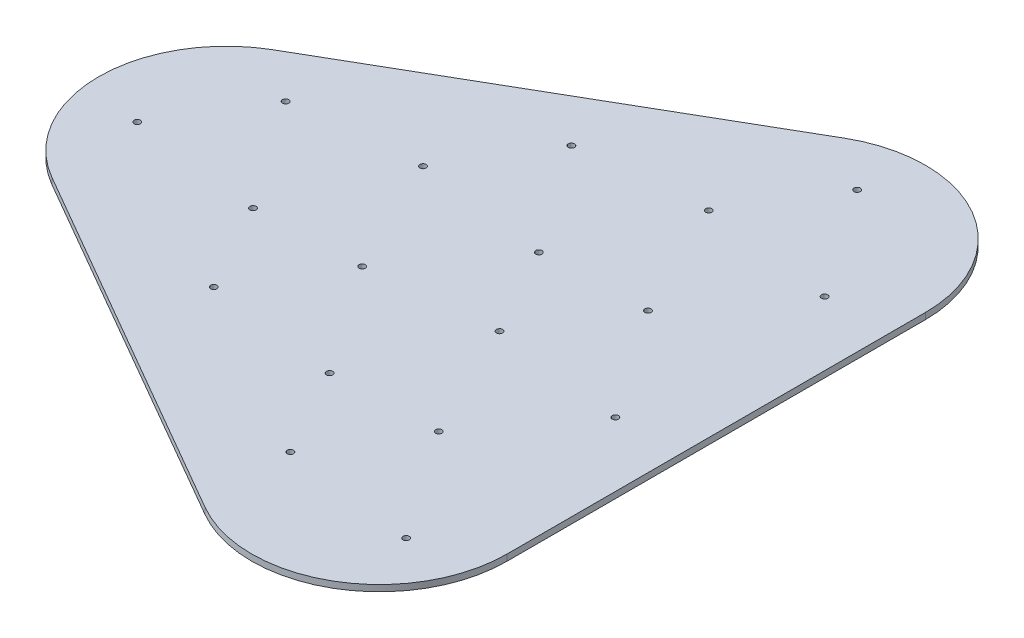
ISO-10303-21;
HEADER;
FILE_DESCRIPTION(('STEP AP214'),'2;1');
FILE_NAME('part.step','',(''),(''),'','','');
FILE_SCHEMA(('AUTOMOTIVE_DESIGN { 1 0 10303 214 1 1 1 1 }'));
ENDSEC;
DATA;
#1=APPLICATION_CONTEXT('core data for automotive mechanical design processes');
#2=APPLICATION_PROTOCOL_DEFINITION('international standard','automotive_design',2000,#1);
#3=PRODUCT_CONTEXT('',#1,'mechanical');
#4=PRODUCT('Part','Part','',(#3));
#5=PRODUCT_RELATED_PRODUCT_CATEGORY('part','',(#4));
#6=PRODUCT_DEFINITION_FORMATION('','',#4);
#7=PRODUCT_DEFINITION_CONTEXT('part definition',#1,'design');
#8=PRODUCT_DEFINITION('design','',#6,#7);
#9=PRODUCT_DEFINITION_SHAPE('','',#8);
#10=(LENGTH_UNIT() NAMED_UNIT(*) SI_UNIT(.MILLI.,.METRE.));
#11=(NAMED_UNIT(*) PLANE_ANGLE_UNIT() SI_UNIT($,.RADIAN.));
#12=(NAMED_UNIT(*) SI_UNIT($,.STERADIAN.) SOLID_ANGLE_UNIT());
#13=UNCERTAINTY_MEASURE_WITH_UNIT(LENGTH_MEASURE(1.E-05),#10,'distance_accuracy_value','');
#14=(GEOMETRIC_REPRESENTATION_CONTEXT(3) GLOBAL_UNCERTAINTY_ASSIGNED_CONTEXT((#13)) GLOBAL_UNIT_ASSIGNED_CONTEXT((#10,
#11,#12)) REPRESENTATION_CONTEXT('',''));
#15=CARTESIAN_POINT('',(0.,0.,0.));
#16=DIRECTION('',(0.,0.,1.));
#17=DIRECTION('',(1.,0.,0.));
#18=AXIS2_PLACEMENT_3D('',#15,#16,#17);
#19=CARTESIAN_POINT('',(-30.5,3.,-52.8275496308508));
#20=DIRECTION('',(-0.5,0.,-0.866025403784439));
#21=DIRECTION('',(-0.866025403784439,0.,0.5));
#22=AXIS2_PLACEMENT_3D('',#19,#20,#21);
#23=PLANE('',#22);
#24=DIRECTION('',(0.866025403784439,0.,-0.5));
#25=VECTOR('',#24,1.);
#26=CARTESIAN_POINT('',(-30.5,0.,-52.8275496308508));
#27=LINE('',#26,#25);
#28=CARTESIAN_POINT('',(-30.5,0.,-52.8275496308508));
#29=VERTEX_POINT('',#28);
#30=CARTESIAN_POINT('',(142.705080756888,0.,-152.827549630851));
#31=VERTEX_POINT('',#30);
#32=EDGE_CURVE('E172',#29,#31,#27,.T.);
#33=ORIENTED_EDGE('',*,*,#32,.F.);
#34=DIRECTION('',(0.,-1.,0.));
#35=VECTOR('',#34,1.);
#36=CARTESIAN_POINT('',(-30.5,3.,-52.8275496308508));
#37=LINE('',#36,#35);
#38=CARTESIAN_POINT('',(-30.5,3.,-52.8275496308508));
#39=VERTEX_POINT('',#38);
#40=EDGE_CURVE('E11',#39,#29,#37,.T.);
#41=ORIENTED_EDGE('',*,*,#40,.F.);
#42=DIRECTION('',(0.866025403784439,0.,-0.5));
#43=VECTOR('',#42,1.);
#44=CARTESIAN_POINT('',(-30.5,3.,-52.8275496308508));
#45=LINE('',#44,#43);
#46=CARTESIAN_POINT('',(142.705080756888,3.,-152.827549630851));
#47=VERTEX_POINT('',#46);
#48=EDGE_CURVE('E238',#39,#47,#45,.T.);
#49=ORIENTED_EDGE('',*,*,#48,.T.);
#50=DIRECTION('',(0.,-1.,0.));
#51=VECTOR('',#50,1.);
#52=CARTESIAN_POINT('',(142.705080756888,3.,-152.827549630851));
#53=LINE('',#52,#51);
#54=EDGE_CURVE('E79',#47,#31,#53,.T.);
#55=ORIENTED_EDGE('',*,*,#54,.T.);
#56=EDGE_LOOP('',(#33,#41,#49,#55));
#57=FACE_BOUND('',#56,.T.);
#58=ADVANCED_FACE('F35',(#57),#23,.T.);
#59=CARTESIAN_POINT('',(0.,3.,0.));
#60=DIRECTION('',(0.,-1.,0.));
#61=DIRECTION('',(0.,0.,-1.));
#62=AXIS2_PLACEMENT_3D('',#59,#60,#61);
#63=CYLINDRICAL_SURFACE('',#62,61.);
#64=CARTESIAN_POINT('',(0.,0.,0.));
#65=DIRECTION('',(0.,1.,0.));
#66=DIRECTION('',(0.,0.,1.));
#67=AXIS2_PLACEMENT_3D('',#64,#65,#66);
#68=CIRCLE('',#67,61.);
#69=CARTESIAN_POINT('',(-30.5,0.,52.8275496308508));
#70=VERTEX_POINT('',#69);
#71=EDGE_CURVE('E175',#29,#70,#68,.T.);
#72=ORIENTED_EDGE('',*,*,#71,.T.);
#73=DIRECTION('',(0.,-1.,0.));
#74=VECTOR('',#73,1.);
#75=CARTESIAN_POINT('',(-30.5,3.,52.8275496308508));
#76=LINE('',#75,#74);
#77=CARTESIAN_POINT('',(-30.5,3.,52.8275496308508));
#78=VERTEX_POINT('',#77);
#79=EDGE_CURVE('E43',#78,#70,#76,.T.);
#80=ORIENTED_EDGE('',*,*,#79,.F.);
#81=CARTESIAN_POINT('',(0.,3.,0.));
#82=DIRECTION('',(0.,1.,0.));
#83=DIRECTION('',(0.,0.,1.));
#84=AXIS2_PLACEMENT_3D('',#81,#82,#83);
#85=CIRCLE('',#84,61.);
#86=EDGE_CURVE('E252',#39,#78,#85,.T.);
#87=ORIENTED_EDGE('',*,*,#86,.F.);
#88=ORIENTED_EDGE('',*,*,#40,.T.);
#89=EDGE_LOOP('',(#72,#80,#87,#88));
#90=FACE_BOUND('',#89,.T.);
#91=ADVANCED_FACE('F255',(#90),#63,.T.);
#92=CARTESIAN_POINT('',(-30.5,3.,52.8275496308508));
#93=DIRECTION('',(0.5,0.,-0.866025403784439));
#94=DIRECTION('',(-0.866025403784439,0.,-0.5));
#95=AXIS2_PLACEMENT_3D('',#92,#93,#94);
#96=PLANE('',#95);
#97=DIRECTION('',(0.866025403784439,0.,0.5));
#98=VECTOR('',#97,1.);
#99=CARTESIAN_POINT('',(-30.5,0.,52.8275496308508));
#100=LINE('',#99,#98);
#101=CARTESIAN_POINT('',(142.705080756888,0.,152.827549630851));
#102=VERTEX_POINT('',#101);
#103=EDGE_CURVE('E177',#70,#102,#100,.T.);
#104=ORIENTED_EDGE('',*,*,#103,.T.);
#105=DIRECTION('',(0.,-1.,0.));
#106=VECTOR('',#105,1.);
#107=CARTESIAN_POINT('',(142.705080756888,3.,152.827549630851));
#108=LINE('',#107,#106);
#109=CARTESIAN_POINT('',(142.705080756888,3.,152.827549630851));
#110=VERTEX_POINT('',#109);
#111=EDGE_CURVE('E111',#110,#102,#108,.T.);
#112=ORIENTED_EDGE('',*,*,#111,.F.);
#113=DIRECTION('',(0.866025403784439,0.,0.5));
#114=VECTOR('',#113,1.);
#115=CARTESIAN_POINT('',(-30.5,3.,52.8275496308508));
#116=LINE('',#115,#114);
#117=EDGE_CURVE('E98',#78,#110,#116,.T.);
#118=ORIENTED_EDGE('',*,*,#117,.F.);
#119=ORIENTED_EDGE('',*,*,#79,.T.);
#120=EDGE_LOOP('',(#104,#112,#118,#119));
#121=FACE_BOUND('',#120,.T.);
#122=ADVANCED_FACE('F245',(#121),#96,.F.);
#123=CARTESIAN_POINT('',(173.205080756888,3.,100.));
#124=DIRECTION('',(0.,-1.,0.));
#125=DIRECTION('',(0.,0.,-1.));
#126=AXIS2_PLACEMENT_3D('',#123,#124,#125);
#127=CYLINDRICAL_SURFACE('',#126,61.);
#128=CARTESIAN_POINT('',(173.205080756888,0.,100.));
#129=DIRECTION('',(0.,1.,0.));
#130=DIRECTION('',(0.,0.,1.));
#131=AXIS2_PLACEMENT_3D('',#128,#129,#130);
#132=CIRCLE('',#131,61.);
#133=CARTESIAN_POINT('',(234.205080756888,0.,100.));
#134=VERTEX_POINT('',#133);
#135=EDGE_CURVE('E107',#102,#134,#132,.T.);
#136=ORIENTED_EDGE('',*,*,#135,.T.);
#137=DIRECTION('',(0.,-1.,0.));
#138=VECTOR('',#137,1.);
#139=CARTESIAN_POINT('',(234.205080756888,3.,100.));
#140=LINE('',#139,#138);
#141=CARTESIAN_POINT('',(234.205080756888,3.,100.));
#142=VERTEX_POINT('',#141);
#143=EDGE_CURVE('E104',#142,#134,#140,.T.);
#144=ORIENTED_EDGE('',*,*,#143,.F.);
#145=CARTESIAN_POINT('',(173.205080756888,3.,100.));
#146=DIRECTION('',(0.,1.,0.));
#147=DIRECTION('',(0.,0.,1.));
#148=AXIS2_PLACEMENT_3D('',#145,#146,#147);
#149=CIRCLE('',#148,61.);
#150=EDGE_CURVE('E91',#110,#142,#149,.T.);
#151=ORIENTED_EDGE('',*,*,#150,.F.);
#152=ORIENTED_EDGE('',*,*,#111,.T.);
#153=EDGE_LOOP('',(#136,#144,#151,#152));
#154=FACE_BOUND('',#153,.T.);
#155=ADVANCED_FACE('F105',(#154),#127,.T.);
#156=CARTESIAN_POINT('',(234.205080756888,3.,0.));
#157=DIRECTION('',(1.,0.,0.));
#158=DIRECTION('',(0.,0.,-1.));
#159=AXIS2_PLACEMENT_3D('',#156,#157,#158);
#160=PLANE('',#159);
#161=DIRECTION('',(0.,0.,1.));
#162=VECTOR('',#161,1.);
#163=CARTESIAN_POINT('',(234.205080756888,0.,0.));
#164=LINE('',#163,#162);
#165=CARTESIAN_POINT('',(234.205080756888,0.,-100.));
#166=VERTEX_POINT('',#165);
#167=EDGE_CURVE('E180',#166,#134,#164,.T.);
#168=ORIENTED_EDGE('',*,*,#167,.F.);
#169=DIRECTION('',(0.,-1.,0.));
#170=VECTOR('',#169,1.);
#171=CARTESIAN_POINT('',(234.205080756888,3.,-100.));
#172=LINE('',#171,#170);
#173=CARTESIAN_POINT('',(234.205080756888,3.,-100.));
#174=VERTEX_POINT('',#173);
#175=EDGE_CURVE('E72',#174,#166,#172,.T.);
#176=ORIENTED_EDGE('',*,*,#175,.F.);
#177=DIRECTION('',(0.,0.,1.));
#178=VECTOR('',#177,1.);
#179=CARTESIAN_POINT('',(234.205080756888,3.,0.));
#180=LINE('',#179,#178);
#181=EDGE_CURVE('E96',#174,#142,#180,.T.);
#182=ORIENTED_EDGE('',*,*,#181,.T.);
#183=ORIENTED_EDGE('',*,*,#143,.T.);
#184=EDGE_LOOP('',(#168,#176,#182,#183));
#185=FACE_BOUND('',#184,.T.);
#186=ADVANCED_FACE('F113',(#185),#160,.T.);
#187=CARTESIAN_POINT('',(-33.02,3.,9.525));
#188=DIRECTION('',(0.,-1.,0.));
#189=DIRECTION('',(0.,0.,-1.));
#190=AXIS2_PLACEMENT_3D('',#187,#188,#189);
#191=CYLINDRICAL_SURFACE('',#190,1.5);
#192=CARTESIAN_POINT('',(-33.02,3.,9.525));
#193=DIRECTION('',(0.,1.,0.));
#194=DIRECTION('',(0.,0.,1.));
#195=AXIS2_PLACEMENT_3D('',#192,#193,#194);
#196=CIRCLE('',#195,1.5);
#197=CARTESIAN_POINT('',(-33.02,3.,11.025));
#198=VERTEX_POINT('',#197);
#199=EDGE_CURVE('E166',#198,#198,#196,.T.);
#200=ORIENTED_EDGE('',*,*,#199,.T.);
#201=EDGE_LOOP('',(#200));
#202=FACE_BOUND('',#201,.T.);
#203=CARTESIAN_POINT('',(-33.02,0.,9.525));
#204=DIRECTION('',(0.,1.,0.));
#205=DIRECTION('',(0.,0.,1.));
#206=AXIS2_PLACEMENT_3D('',#203,#204,#205);
#207=CIRCLE('',#206,1.5);
#208=CARTESIAN_POINT('',(-33.02,0.,11.025));
#209=VERTEX_POINT('',#208);
#210=EDGE_CURVE('E232',#209,#209,#207,.T.);
#211=ORIENTED_EDGE('',*,*,#210,.F.);
#212=EDGE_LOOP('',(#211));
#213=FACE_BOUND('',#212,.T.);
#214=ADVANCED_FACE('F267',(#202,#213),#191,.F.);
#215=CARTESIAN_POINT('',(30.310889,3.,17.500001));
#216=DIRECTION('',(0.,-1.,0.));
#217=DIRECTION('',(0.,0.,-1.));
#218=AXIS2_PLACEMENT_3D('',#215,#216,#217);
#219=CYLINDRICAL_SURFACE('',#218,1.5);
#220=CARTESIAN_POINT('',(30.310889,3.,17.500001));
#221=DIRECTION('',(0.,1.,0.));
#222=DIRECTION('',(0.,0.,1.));
#223=AXIS2_PLACEMENT_3D('',#220,#221,#222);
#224=CIRCLE('',#223,1.5);
#225=CARTESIAN_POINT('',(30.310889,3.,19.000001));
#226=VERTEX_POINT('',#225);
#227=EDGE_CURVE('E163',#226,#226,#224,.T.);
#228=ORIENTED_EDGE('',*,*,#227,.T.);
#229=EDGE_LOOP('',(#228));
#230=FACE_BOUND('',#229,.T.);
#231=CARTESIAN_POINT('',(30.310889,0.,17.500001));
#232=DIRECTION('',(0.,1.,0.));
#233=DIRECTION('',(0.,0.,1.));
#234=AXIS2_PLACEMENT_3D('',#231,#232,#233);
#235=CIRCLE('',#234,1.5);
#236=CARTESIAN_POINT('',(30.310889,0.,19.000001));
#237=VERTEX_POINT('',#236);
#238=EDGE_CURVE('E229',#237,#237,#235,.T.);
#239=ORIENTED_EDGE('',*,*,#238,.F.);
#240=EDGE_LOOP('',(#239));
#241=FACE_BOUND('',#240,.T.);
#242=ADVANCED_FACE('F330',(#230,#241),#219,.F.);
#243=CARTESIAN_POINT('',(80.5248543784439,3.,15.531728));
#244=DIRECTION('',(0.,-1.,0.));
#245=DIRECTION('',(0.,0.,-1.));
#246=AXIS2_PLACEMENT_3D('',#243,#244,#245);
#247=CYLINDRICAL_SURFACE('',#246,1.5);
#248=CARTESIAN_POINT('',(80.5248543784439,3.,15.531728));
#249=DIRECTION('',(0.,1.,0.));
#250=DIRECTION('',(0.,0.,1.));
#251=AXIS2_PLACEMENT_3D('',#248,#249,#250);
#252=CIRCLE('',#251,1.5);
#253=CARTESIAN_POINT('',(80.5248543784439,3.,17.031728));
#254=VERTEX_POINT('',#253);
#255=EDGE_CURVE('E160',#254,#254,#252,.T.);
#256=ORIENTED_EDGE('',*,*,#255,.T.);
#257=EDGE_LOOP('',(#256));
#258=FACE_BOUND('',#257,.T.);
#259=CARTESIAN_POINT('',(80.5248543784439,0.,15.531728));
#260=DIRECTION('',(0.,1.,0.));
#261=DIRECTION('',(0.,0.,1.));
#262=AXIS2_PLACEMENT_3D('',#259,#260,#261);
#263=CIRCLE('',#262,1.5);
#264=CARTESIAN_POINT('',(80.5248543784439,0.,17.031728));
#265=VERTEX_POINT('',#264);
#266=EDGE_CURVE('E226',#265,#265,#263,.T.);
#267=ORIENTED_EDGE('',*,*,#266,.F.);
#268=EDGE_LOOP('',(#267));
#269=FACE_BOUND('',#268,.T.);
#270=ADVANCED_FACE('F326',(#258,#269),#247,.F.);
#271=CARTESIAN_POINT('',(53.5825403784439,3.,59.525));
#272=DIRECTION('',(0.,-1.,0.));
#273=DIRECTION('',(0.,0.,-1.));
#274=AXIS2_PLACEMENT_3D('',#271,#272,#273);
#275=CYLINDRICAL_SURFACE('',#274,1.5);
#276=CARTESIAN_POINT('',(53.5825403784439,3.,59.525));
#277=DIRECTION('',(0.,1.,0.));
#278=DIRECTION('',(0.,0.,1.));
#279=AXIS2_PLACEMENT_3D('',#276,#277,#278);
#280=CIRCLE('',#279,1.5);
#281=CARTESIAN_POINT('',(53.5825403784439,3.,61.025));
#282=VERTEX_POINT('',#281);
#283=EDGE_CURVE('E157',#282,#282,#280,.T.);
#284=ORIENTED_EDGE('',*,*,#283,.T.);
#285=EDGE_LOOP('',(#284));
#286=FACE_BOUND('',#285,.T.);
#287=CARTESIAN_POINT('',(53.5825403784439,0.,59.525));
#288=DIRECTION('',(0.,1.,0.));
#289=DIRECTION('',(0.,0.,1.));
#290=AXIS2_PLACEMENT_3D('',#287,#288,#289);
#291=CIRCLE('',#290,1.5);
#292=CARTESIAN_POINT('',(53.5825403784439,0.,61.025));
#293=VERTEX_POINT('',#292);
#294=EDGE_CURVE('E223',#293,#293,#291,.T.);
#295=ORIENTED_EDGE('',*,*,#294,.F.);
#296=EDGE_LOOP('',(#295));
#297=FACE_BOUND('',#296,.T.);
#298=ADVANCED_FACE('F322',(#286,#297),#275,.F.);
#299=CARTESIAN_POINT('',(116.913429378444,3.,67.500001));
#300=DIRECTION('',(0.,-1.,0.));
#301=DIRECTION('',(0.,0.,-1.));
#302=AXIS2_PLACEMENT_3D('',#299,#300,#301);
#303=CYLINDRICAL_SURFACE('',#302,1.5);
#304=CARTESIAN_POINT('',(116.913429378444,3.,67.500001));
#305=DIRECTION('',(0.,1.,0.));
#306=DIRECTION('',(0.,0.,1.));
#307=AXIS2_PLACEMENT_3D('',#304,#305,#306);
#308=CIRCLE('',#307,1.5);
#309=CARTESIAN_POINT('',(116.913429378444,3.,69.000001));
#310=VERTEX_POINT('',#309);
#311=EDGE_CURVE('E154',#310,#310,#308,.T.);
#312=ORIENTED_EDGE('',*,*,#311,.T.);
#313=EDGE_LOOP('',(#312));
#314=FACE_BOUND('',#313,.T.);
#315=CARTESIAN_POINT('',(116.913429378444,0.,67.500001));
#316=DIRECTION('',(0.,1.,0.));
#317=DIRECTION('',(0.,0.,1.));
#318=AXIS2_PLACEMENT_3D('',#315,#316,#317);
#319=CIRCLE('',#318,1.5);
#320=CARTESIAN_POINT('',(116.913429378444,0.,69.000001));
#321=VERTEX_POINT('',#320);
#322=EDGE_CURVE('E220',#321,#321,#319,.T.);
#323=ORIENTED_EDGE('',*,*,#322,.F.);
#324=EDGE_LOOP('',(#323));
#325=FACE_BOUND('',#324,.T.);
#326=ADVANCED_FACE('F318',(#314,#325),#303,.F.);
#327=CARTESIAN_POINT('',(80.5248543784439,3.,-84.468272));
#328=DIRECTION('',(0.,-1.,0.));
#329=DIRECTION('',(0.,0.,-1.));
#330=AXIS2_PLACEMENT_3D('',#327,#328,#329);
#331=CYLINDRICAL_SURFACE('',#330,1.5);
#332=CARTESIAN_POINT('',(80.5248543784439,3.,-84.468272));
#333=DIRECTION('',(0.,1.,0.));
#334=DIRECTION('',(0.,0.,1.));
#335=AXIS2_PLACEMENT_3D('',#332,#333,#334);
#336=CIRCLE('',#335,1.5);
#337=CARTESIAN_POINT('',(80.5248543784439,3.,-82.968272));
#338=VERTEX_POINT('',#337);
#339=EDGE_CURVE('E151',#338,#338,#336,.T.);
#340=ORIENTED_EDGE('',*,*,#339,.T.);
#341=EDGE_LOOP('',(#340));
#342=FACE_BOUND('',#341,.T.);
#343=CARTESIAN_POINT('',(80.5248543784439,0.,-84.468272));
#344=DIRECTION('',(0.,1.,0.));
#345=DIRECTION('',(0.,0.,1.));
#346=AXIS2_PLACEMENT_3D('',#343,#344,#345);
#347=CIRCLE('',#346,1.5);
#348=CARTESIAN_POINT('',(80.5248543784439,0.,-82.968272));
#349=VERTEX_POINT('',#348);
#350=EDGE_CURVE('E217',#349,#349,#347,.T.);
#351=ORIENTED_EDGE('',*,*,#350,.F.);
#352=EDGE_LOOP('',(#351));
#353=FACE_BOUND('',#352,.T.);
#354=ADVANCED_FACE('F314',(#342,#353),#331,.F.);
#355=CARTESIAN_POINT('',(53.5825403784439,3.,-40.475));
#356=DIRECTION('',(0.,-1.,0.));
#357=DIRECTION('',(0.,0.,-1.));
#358=AXIS2_PLACEMENT_3D('',#355,#356,#357);
#359=CYLINDRICAL_SURFACE('',#358,1.49999999999999);
#360=CARTESIAN_POINT('',(53.5825403784439,3.,-40.475));
#361=DIRECTION('',(0.,1.,0.));
#362=DIRECTION('',(0.,0.,1.));
#363=AXIS2_PLACEMENT_3D('',#360,#361,#362);
#364=CIRCLE('',#363,1.49999999999999);
#365=CARTESIAN_POINT('',(53.5825403784439,3.,-38.975));
#366=VERTEX_POINT('',#365);
#367=EDGE_CURVE('E148',#366,#366,#364,.T.);
#368=ORIENTED_EDGE('',*,*,#367,.T.);
#369=EDGE_LOOP('',(#368));
#370=FACE_BOUND('',#369,.T.);
#371=CARTESIAN_POINT('',(53.5825403784439,0.,-40.475));
#372=DIRECTION('',(0.,1.,0.));
#373=DIRECTION('',(0.,0.,1.));
#374=AXIS2_PLACEMENT_3D('',#371,#372,#373);
#375=CIRCLE('',#374,1.49999999999999);
#376=CARTESIAN_POINT('',(53.5825403784439,0.,-38.975));
#377=VERTEX_POINT('',#376);
#378=EDGE_CURVE('E214',#377,#377,#375,.T.);
#379=ORIENTED_EDGE('',*,*,#378,.F.);
#380=EDGE_LOOP('',(#379));
#381=FACE_BOUND('',#380,.T.);
#382=ADVANCED_FACE('F310',(#370,#381),#359,.F.);
#383=CARTESIAN_POINT('',(116.913429378444,3.,-32.499999));
#384=DIRECTION('',(0.,-1.,0.));
#385=DIRECTION('',(0.,0.,-1.));
#386=AXIS2_PLACEMENT_3D('',#383,#384,#385);
#387=CYLINDRICAL_SURFACE('',#386,1.5);
#388=CARTESIAN_POINT('',(116.913429378444,3.,-32.499999));
#389=DIRECTION('',(0.,1.,0.));
#390=DIRECTION('',(0.,0.,1.));
#391=AXIS2_PLACEMENT_3D('',#388,#389,#390);
#392=CIRCLE('',#391,1.5);
#393=CARTESIAN_POINT('',(116.913429378444,3.,-30.999999));
#394=VERTEX_POINT('',#393);
#395=EDGE_CURVE('E145',#394,#394,#392,.T.);
#396=ORIENTED_EDGE('',*,*,#395,.T.);
#397=EDGE_LOOP('',(#396));
#398=FACE_BOUND('',#397,.T.);
#399=CARTESIAN_POINT('',(116.913429378444,0.,-32.499999));
#400=DIRECTION('',(0.,1.,0.));
#401=DIRECTION('',(0.,0.,1.));
#402=AXIS2_PLACEMENT_3D('',#399,#400,#401);
#403=CIRCLE('',#402,1.5);
#404=CARTESIAN_POINT('',(116.913429378444,0.,-30.999999));
#405=VERTEX_POINT('',#404);
#406=EDGE_CURVE('E211',#405,#405,#403,.T.);
#407=ORIENTED_EDGE('',*,*,#406,.F.);
#408=EDGE_LOOP('',(#407));
#409=FACE_BOUND('',#408,.T.);
#410=ADVANCED_FACE('F306',(#398,#409),#387,.F.);
#411=CARTESIAN_POINT('',(167.127394756888,3.,65.531728));
#412=DIRECTION('',(0.,-1.,0.));
#413=DIRECTION('',(0.,0.,-1.));
#414=AXIS2_PLACEMENT_3D('',#411,#412,#413);
#415=CYLINDRICAL_SURFACE('',#414,1.5);
#416=CARTESIAN_POINT('',(167.127394756888,3.,65.531728));
#417=DIRECTION('',(0.,1.,0.));
#418=DIRECTION('',(0.,0.,1.));
#419=AXIS2_PLACEMENT_3D('',#416,#417,#418);
#420=CIRCLE('',#419,1.5);
#421=CARTESIAN_POINT('',(167.127394756888,3.,67.031728));
#422=VERTEX_POINT('',#421);
#423=EDGE_CURVE('E142',#422,#422,#420,.T.);
#424=ORIENTED_EDGE('',*,*,#423,.T.);
#425=EDGE_LOOP('',(#424));
#426=FACE_BOUND('',#425,.T.);
#427=CARTESIAN_POINT('',(167.127394756888,0.,65.531728));
#428=DIRECTION('',(0.,1.,0.));
#429=DIRECTION('',(0.,0.,1.));
#430=AXIS2_PLACEMENT_3D('',#427,#428,#429);
#431=CIRCLE('',#430,1.5);
#432=CARTESIAN_POINT('',(167.127394756888,0.,67.031728));
#433=VERTEX_POINT('',#432);
#434=EDGE_CURVE('E208',#433,#433,#431,.T.);
#435=ORIENTED_EDGE('',*,*,#434,.F.);
#436=EDGE_LOOP('',(#435));
#437=FACE_BOUND('',#436,.T.);
#438=ADVANCED_FACE('F302',(#426,#437),#415,.F.);
#439=CARTESIAN_POINT('',(140.185080756888,3.,109.525));
#440=DIRECTION('',(0.,-1.,0.));
#441=DIRECTION('',(0.,0.,-1.));
#442=AXIS2_PLACEMENT_3D('',#439,#440,#441);
#443=CYLINDRICAL_SURFACE('',#442,1.49999999999997);
#444=CARTESIAN_POINT('',(140.185080756888,3.,109.525));
#445=DIRECTION('',(0.,1.,0.));
#446=DIRECTION('',(0.,0.,1.));
#447=AXIS2_PLACEMENT_3D('',#444,#445,#446);
#448=CIRCLE('',#447,1.49999999999997);
#449=CARTESIAN_POINT('',(140.185080756888,3.,111.025));
#450=VERTEX_POINT('',#449);
#451=EDGE_CURVE('E139',#450,#450,#448,.T.);
#452=ORIENTED_EDGE('',*,*,#451,.T.);
#453=EDGE_LOOP('',(#452));
#454=FACE_BOUND('',#453,.T.);
#455=CARTESIAN_POINT('',(140.185080756888,0.,109.525));
#456=DIRECTION('',(0.,1.,0.));
#457=DIRECTION('',(0.,0.,1.));
#458=AXIS2_PLACEMENT_3D('',#455,#456,#457);
#459=CIRCLE('',#458,1.49999999999997);
#460=CARTESIAN_POINT('',(140.185080756888,0.,111.025));
#461=VERTEX_POINT('',#460);
#462=EDGE_CURVE('E205',#461,#461,#459,.T.);
#463=ORIENTED_EDGE('',*,*,#462,.F.);
#464=EDGE_LOOP('',(#463));
#465=FACE_BOUND('',#464,.T.);
#466=ADVANCED_FACE('F298',(#454,#465),#443,.F.);
#467=CARTESIAN_POINT('',(203.515969756888,3.,117.500001));
#468=DIRECTION('',(0.,-1.,0.));
#469=DIRECTION('',(0.,0.,-1.));
#470=AXIS2_PLACEMENT_3D('',#467,#468,#469);
#471=CYLINDRICAL_SURFACE('',#470,1.5);
#472=CARTESIAN_POINT('',(203.515969756888,3.,117.500001));
#473=DIRECTION('',(0.,1.,0.));
#474=DIRECTION('',(0.,0.,1.));
#475=AXIS2_PLACEMENT_3D('',#472,#473,#474);
#476=CIRCLE('',#475,1.5);
#477=CARTESIAN_POINT('',(203.515969756888,3.,119.000001));
#478=VERTEX_POINT('',#477);
#479=EDGE_CURVE('E136',#478,#478,#476,.T.);
#480=ORIENTED_EDGE('',*,*,#479,.T.);
#481=EDGE_LOOP('',(#480));
#482=FACE_BOUND('',#481,.T.);
#483=CARTESIAN_POINT('',(203.515969756888,0.,117.500001));
#484=DIRECTION('',(0.,1.,0.));
#485=DIRECTION('',(0.,0.,1.));
#486=AXIS2_PLACEMENT_3D('',#483,#484,#485);
#487=CIRCLE('',#486,1.5);
#488=CARTESIAN_POINT('',(203.515969756888,0.,119.000001));
#489=VERTEX_POINT('',#488);
#490=EDGE_CURVE('E202',#489,#489,#487,.T.);
#491=ORIENTED_EDGE('',*,*,#490,.F.);
#492=EDGE_LOOP('',(#491));
#493=FACE_BOUND('',#492,.T.);
#494=ADVANCED_FACE('F294',(#482,#493),#471,.F.);
#495=CARTESIAN_POINT('',(167.127394756888,3.,-134.468272));
#496=DIRECTION('',(0.,-1.,0.));
#497=DIRECTION('',(0.,0.,-1.));
#498=AXIS2_PLACEMENT_3D('',#495,#496,#497);
#499=CYLINDRICAL_SURFACE('',#498,1.5);
#500=CARTESIAN_POINT('',(167.127394756888,3.,-134.468272));
#501=DIRECTION('',(0.,1.,0.));
#502=DIRECTION('',(0.,0.,1.));
#503=AXIS2_PLACEMENT_3D('',#500,#501,#502);
#504=CIRCLE('',#503,1.5);
#505=CARTESIAN_POINT('',(167.127394756888,3.,-132.968272));
#506=VERTEX_POINT('',#505);
#507=EDGE_CURVE('E133',#506,#506,#504,.T.);
#508=ORIENTED_EDGE('',*,*,#507,.T.);
#509=EDGE_LOOP('',(#508));
#510=FACE_BOUND('',#509,.T.);
#511=CARTESIAN_POINT('',(167.127394756888,0.,-134.468272));
#512=DIRECTION('',(0.,1.,0.));
#513=DIRECTION('',(0.,0.,1.));
#514=AXIS2_PLACEMENT_3D('',#511,#512,#513);
#515=CIRCLE('',#514,1.5);
#516=CARTESIAN_POINT('',(167.127394756888,0.,-132.968272));
#517=VERTEX_POINT('',#516);
#518=EDGE_CURVE('E199',#517,#517,#515,.T.);
#519=ORIENTED_EDGE('',*,*,#518,.F.);
#520=EDGE_LOOP('',(#519));
#521=FACE_BOUND('',#520,.T.);
#522=ADVANCED_FACE('F290',(#510,#521),#499,.F.);
#523=CARTESIAN_POINT('',(140.185080756888,3.,-90.475));
#524=DIRECTION('',(0.,-1.,0.));
#525=DIRECTION('',(0.,0.,-1.));
#526=AXIS2_PLACEMENT_3D('',#523,#524,#525);
#527=CYLINDRICAL_SURFACE('',#526,1.49999999999997);
#528=CARTESIAN_POINT('',(140.185080756888,3.,-90.475));
#529=DIRECTION('',(0.,1.,0.));
#530=DIRECTION('',(0.,0.,1.));
#531=AXIS2_PLACEMENT_3D('',#528,#529,#530);
#532=CIRCLE('',#531,1.49999999999997);
#533=CARTESIAN_POINT('',(140.185080756888,3.,-88.975));
#534=VERTEX_POINT('',#533);
#535=EDGE_CURVE('E130',#534,#534,#532,.T.);
#536=ORIENTED_EDGE('',*,*,#535,.T.);
#537=EDGE_LOOP('',(#536));
#538=FACE_BOUND('',#537,.T.);
#539=CARTESIAN_POINT('',(140.185080756888,0.,-90.475));
#540=DIRECTION('',(0.,1.,0.));
#541=DIRECTION('',(0.,0.,1.));
#542=AXIS2_PLACEMENT_3D('',#539,#540,#541);
#543=CIRCLE('',#542,1.49999999999997);
#544=CARTESIAN_POINT('',(140.185080756888,0.,-88.975));
#545=VERTEX_POINT('',#544);
#546=EDGE_CURVE('E196',#545,#545,#543,.T.);
#547=ORIENTED_EDGE('',*,*,#546,.F.);
#548=EDGE_LOOP('',(#547));
#549=FACE_BOUND('',#548,.T.);
#550=ADVANCED_FACE('F286',(#538,#549),#527,.F.);
#551=CARTESIAN_POINT('',(203.515969756888,3.,-82.499999));
#552=DIRECTION('',(0.,-1.,0.));
#553=DIRECTION('',(0.,0.,-1.));
#554=AXIS2_PLACEMENT_3D('',#551,#552,#553);
#555=CYLINDRICAL_SURFACE('',#554,1.5);
#556=CARTESIAN_POINT('',(203.515969756888,3.,-82.499999));
#557=DIRECTION('',(0.,1.,0.));
#558=DIRECTION('',(0.,0.,1.));
#559=AXIS2_PLACEMENT_3D('',#556,#557,#558);
#560=CIRCLE('',#559,1.5);
#561=CARTESIAN_POINT('',(203.515969756888,3.,-80.999999));
#562=VERTEX_POINT('',#561);
#563=EDGE_CURVE('E127',#562,#562,#560,.T.);
#564=ORIENTED_EDGE('',*,*,#563,.T.);
#565=EDGE_LOOP('',(#564));
#566=FACE_BOUND('',#565,.T.);
#567=CARTESIAN_POINT('',(203.515969756888,0.,-82.499999));
#568=DIRECTION('',(0.,1.,0.));
#569=DIRECTION('',(0.,0.,1.));
#570=AXIS2_PLACEMENT_3D('',#567,#568,#569);
#571=CIRCLE('',#570,1.5);
#572=CARTESIAN_POINT('',(203.515969756888,0.,-80.999999));
#573=VERTEX_POINT('',#572);
#574=EDGE_CURVE('E193',#573,#573,#571,.T.);
#575=ORIENTED_EDGE('',*,*,#574,.F.);
#576=EDGE_LOOP('',(#575));
#577=FACE_BOUND('',#576,.T.);
#578=ADVANCED_FACE('F282',(#566,#577),#555,.F.);
#579=CARTESIAN_POINT('',(167.127394756888,3.,-34.468272));
#580=DIRECTION('',(0.,-1.,0.));
#581=DIRECTION('',(0.,0.,-1.));
#582=AXIS2_PLACEMENT_3D('',#579,#580,#581);
#583=CYLINDRICAL_SURFACE('',#582,1.5);
#584=CARTESIAN_POINT('',(167.127394756888,3.,-34.468272));
#585=DIRECTION('',(0.,1.,0.));
#586=DIRECTION('',(0.,0.,1.));
#587=AXIS2_PLACEMENT_3D('',#584,#585,#586);
#588=CIRCLE('',#587,1.5);
#589=CARTESIAN_POINT('',(167.127394756888,3.,-32.968272));
#590=VERTEX_POINT('',#589);
#591=EDGE_CURVE('E124',#590,#590,#588,.T.);
#592=ORIENTED_EDGE('',*,*,#591,.T.);
#593=EDGE_LOOP('',(#592));
#594=FACE_BOUND('',#593,.T.);
#595=CARTESIAN_POINT('',(167.127394756888,0.,-34.468272));
#596=DIRECTION('',(0.,1.,0.));
#597=DIRECTION('',(0.,0.,1.));
#598=AXIS2_PLACEMENT_3D('',#595,#596,#597);
#599=CIRCLE('',#598,1.5);
#600=CARTESIAN_POINT('',(167.127394756888,0.,-32.968272));
#601=VERTEX_POINT('',#600);
#602=EDGE_CURVE('E190',#601,#601,#599,.T.);
#603=ORIENTED_EDGE('',*,*,#602,.F.);
#604=EDGE_LOOP('',(#603));
#605=FACE_BOUND('',#604,.T.);
#606=ADVANCED_FACE('F278',(#594,#605),#583,.F.);
#607=CARTESIAN_POINT('',(140.185080756888,3.,9.525));
#608=DIRECTION('',(0.,-1.,0.));
#609=DIRECTION('',(0.,0.,-1.));
#610=AXIS2_PLACEMENT_3D('',#607,#608,#609);
#611=CYLINDRICAL_SURFACE('',#610,1.49999999999997);
#612=CARTESIAN_POINT('',(140.185080756888,3.,9.525));
#613=DIRECTION('',(0.,1.,0.));
#614=DIRECTION('',(0.,0.,1.));
#615=AXIS2_PLACEMENT_3D('',#612,#613,#614);
#616=CIRCLE('',#615,1.49999999999997);
#617=CARTESIAN_POINT('',(140.185080756888,3.,11.025));
#618=VERTEX_POINT('',#617);
#619=EDGE_CURVE('E121',#618,#618,#616,.T.);
#620=ORIENTED_EDGE('',*,*,#619,.T.);
#621=EDGE_LOOP('',(#620));
#622=FACE_BOUND('',#621,.T.);
#623=CARTESIAN_POINT('',(140.185080756888,0.,9.525));
#624=DIRECTION('',(0.,1.,0.));
#625=DIRECTION('',(0.,0.,1.));
#626=AXIS2_PLACEMENT_3D('',#623,#624,#625);
#627=CIRCLE('',#626,1.49999999999997);
#628=CARTESIAN_POINT('',(140.185080756888,0.,11.025));
#629=VERTEX_POINT('',#628);
#630=EDGE_CURVE('E187',#629,#629,#627,.T.);
#631=ORIENTED_EDGE('',*,*,#630,.F.);
#632=EDGE_LOOP('',(#631));
#633=FACE_BOUND('',#632,.T.);
#634=ADVANCED_FACE('F274',(#622,#633),#611,.F.);
#635=CARTESIAN_POINT('',(203.515969756888,3.,17.500001));
#636=DIRECTION('',(0.,-1.,0.));
#637=DIRECTION('',(0.,0.,-1.));
#638=AXIS2_PLACEMENT_3D('',#635,#636,#637);
#639=CYLINDRICAL_SURFACE('',#638,1.50000000000003);
#640=CARTESIAN_POINT('',(203.515969756888,3.,17.500001));
#641=DIRECTION('',(0.,1.,0.));
#642=DIRECTION('',(0.,0.,1.));
#643=AXIS2_PLACEMENT_3D('',#640,#641,#642);
#644=CIRCLE('',#643,1.50000000000003);
#645=CARTESIAN_POINT('',(203.515969756888,3.,19.000001));
#646=VERTEX_POINT('',#645);
#647=EDGE_CURVE('E115',#646,#646,#644,.T.);
#648=ORIENTED_EDGE('',*,*,#647,.T.);
#649=EDGE_LOOP('',(#648));
#650=FACE_BOUND('',#649,.T.);
#651=CARTESIAN_POINT('',(203.515969756888,0.,17.500001));
#652=DIRECTION('',(0.,1.,0.));
#653=DIRECTION('',(0.,0.,1.));
#654=AXIS2_PLACEMENT_3D('',#651,#652,#653);
#655=CIRCLE('',#654,1.50000000000003);
#656=CARTESIAN_POINT('',(203.515969756888,0.,19.000001));
#657=VERTEX_POINT('',#656);
#658=EDGE_CURVE('E184',#657,#657,#655,.T.);
#659=ORIENTED_EDGE('',*,*,#658,.F.);
#660=EDGE_LOOP('',(#659));
#661=FACE_BOUND('',#660,.T.);
#662=ADVANCED_FACE('F271',(#650,#661),#639,.F.);
#663=CARTESIAN_POINT('',(173.205080756888,3.,-100.));
#664=DIRECTION('',(0.,-1.,0.));
#665=DIRECTION('',(0.,0.,-1.));
#666=AXIS2_PLACEMENT_3D('',#663,#664,#665);
#667=CYLINDRICAL_SURFACE('',#666,61.);
#668=CARTESIAN_POINT('',(173.205080756888,0.,-100.));
#669=DIRECTION('',(0.,1.,0.));
#670=DIRECTION('',(0.,0.,1.));
#671=AXIS2_PLACEMENT_3D('',#668,#669,#670);
#672=CIRCLE('',#671,61.);
#673=EDGE_CURVE('E182',#166,#31,#672,.T.);
#674=ORIENTED_EDGE('',*,*,#673,.T.);
#675=ORIENTED_EDGE('',*,*,#54,.F.);
#676=CARTESIAN_POINT('',(173.205080756888,3.,-100.));
#677=DIRECTION('',(0.,1.,0.));
#678=DIRECTION('',(0.,0.,1.));
#679=AXIS2_PLACEMENT_3D('',#676,#677,#678);
#680=CIRCLE('',#679,61.);
#681=EDGE_CURVE('E51',#174,#47,#680,.T.);
#682=ORIENTED_EDGE('',*,*,#681,.F.);
#683=ORIENTED_EDGE('',*,*,#175,.T.);
#684=EDGE_LOOP('',(#674,#675,#682,#683));
#685=FACE_BOUND('',#684,.T.);
#686=ADVANCED_FACE('F251',(#685),#667,.T.);
#687=CARTESIAN_POINT('',(-6.077686,3.,-34.468272));
#688=DIRECTION('',(0.,-1.,0.));
#689=DIRECTION('',(0.,0.,-1.));
#690=AXIS2_PLACEMENT_3D('',#687,#688,#689);
#691=CYLINDRICAL_SURFACE('',#690,1.5);
#692=CARTESIAN_POINT('',(-6.077686,3.,-34.468272));
#693=DIRECTION('',(0.,1.,0.));
#694=DIRECTION('',(0.,0.,1.));
#695=AXIS2_PLACEMENT_3D('',#692,#693,#694);
#696=CIRCLE('',#695,1.5);
#697=CARTESIAN_POINT('',(-6.077686,3.,-32.968272));
#698=VERTEX_POINT('',#697);
#699=EDGE_CURVE('E169',#698,#698,#696,.T.);
#700=ORIENTED_EDGE('',*,*,#699,.T.);
#701=EDGE_LOOP('',(#700));
#702=FACE_BOUND('',#701,.T.);
#703=CARTESIAN_POINT('',(-6.077686,0.,-34.468272));
#704=DIRECTION('',(0.,1.,0.));
#705=DIRECTION('',(0.,0.,1.));
#706=AXIS2_PLACEMENT_3D('',#703,#704,#705);
#707=CIRCLE('',#706,1.5);
#708=CARTESIAN_POINT('',(-6.077686,0.,-32.968272));
#709=VERTEX_POINT('',#708);
#710=EDGE_CURVE('E235',#709,#709,#707,.T.);
#711=ORIENTED_EDGE('',*,*,#710,.F.);
#712=EDGE_LOOP('',(#711));
#713=FACE_BOUND('',#712,.T.);
#714=ADVANCED_FACE('F270',(#702,#713),#691,.F.);
#715=CARTESIAN_POINT('',(0.,3.,0.));
#716=DIRECTION('',(0.,1.,0.));
#717=DIRECTION('',(0.,0.,1.));
#718=AXIS2_PLACEMENT_3D('',#715,#716,#717);
#719=PLANE('',#718);
#720=ORIENTED_EDGE('',*,*,#48,.F.);
#721=ORIENTED_EDGE('',*,*,#86,.T.);
#722=ORIENTED_EDGE('',*,*,#117,.T.);
#723=ORIENTED_EDGE('',*,*,#150,.T.);
#724=ORIENTED_EDGE('',*,*,#181,.F.);
#725=ORIENTED_EDGE('',*,*,#681,.T.);
#726=EDGE_LOOP('',(#720,#721,#722,#723,#724,#725));
#727=FACE_BOUND('',#726,.T.);
#728=ORIENTED_EDGE('',*,*,#647,.F.);
#729=EDGE_LOOP('',(#728));
#730=FACE_BOUND('',#729,.T.);
#731=ORIENTED_EDGE('',*,*,#619,.F.);
#732=EDGE_LOOP('',(#731));
#733=FACE_BOUND('',#732,.T.);
#734=ORIENTED_EDGE('',*,*,#591,.F.);
#735=EDGE_LOOP('',(#734));
#736=FACE_BOUND('',#735,.T.);
#737=ORIENTED_EDGE('',*,*,#563,.F.);
#738=EDGE_LOOP('',(#737));
#739=FACE_BOUND('',#738,.T.);
#740=ORIENTED_EDGE('',*,*,#535,.F.);
#741=EDGE_LOOP('',(#740));
#742=FACE_BOUND('',#741,.T.);
#743=ORIENTED_EDGE('',*,*,#507,.F.);
#744=EDGE_LOOP('',(#743));
#745=FACE_BOUND('',#744,.T.);
#746=ORIENTED_EDGE('',*,*,#479,.F.);
#747=EDGE_LOOP('',(#746));
#748=FACE_BOUND('',#747,.T.);
#749=ORIENTED_EDGE('',*,*,#451,.F.);
#750=EDGE_LOOP('',(#749));
#751=FACE_BOUND('',#750,.T.);
#752=ORIENTED_EDGE('',*,*,#423,.F.);
#753=EDGE_LOOP('',(#752));
#754=FACE_BOUND('',#753,.T.);
#755=ORIENTED_EDGE('',*,*,#395,.F.);
#756=EDGE_LOOP('',(#755));
#757=FACE_BOUND('',#756,.T.);
#758=ORIENTED_EDGE('',*,*,#367,.F.);
#759=EDGE_LOOP('',(#758));
#760=FACE_BOUND('',#759,.T.);
#761=ORIENTED_EDGE('',*,*,#339,.F.);
#762=EDGE_LOOP('',(#761));
#763=FACE_BOUND('',#762,.T.);
#764=ORIENTED_EDGE('',*,*,#311,.F.);
#765=EDGE_LOOP('',(#764));
#766=FACE_BOUND('',#765,.T.);
#767=ORIENTED_EDGE('',*,*,#283,.F.);
#768=EDGE_LOOP('',(#767));
#769=FACE_BOUND('',#768,.T.);
#770=ORIENTED_EDGE('',*,*,#255,.F.);
#771=EDGE_LOOP('',(#770));
#772=FACE_BOUND('',#771,.T.);
#773=ORIENTED_EDGE('',*,*,#227,.F.);
#774=EDGE_LOOP('',(#773));
#775=FACE_BOUND('',#774,.T.);
#776=ORIENTED_EDGE('',*,*,#199,.F.);
#777=EDGE_LOOP('',(#776));
#778=FACE_BOUND('',#777,.T.);
#779=ORIENTED_EDGE('',*,*,#699,.F.);
#780=EDGE_LOOP('',(#779));
#781=FACE_BOUND('',#780,.T.);
#782=ADVANCED_FACE('F93',(#727,#730,#733,#736,#739,#742,#745,#748,#751,#754,#757,#760,#763,#766,
#769,#772,#775,#778,#781),#719,.T.);
#783=CARTESIAN_POINT('',(0.,0.,0.));
#784=DIRECTION('',(0.,1.,0.));
#785=DIRECTION('',(0.,0.,1.));
#786=AXIS2_PLACEMENT_3D('',#783,#784,#785);
#787=PLANE('',#786);
#788=ORIENTED_EDGE('',*,*,#32,.T.);
#789=ORIENTED_EDGE('',*,*,#673,.F.);
#790=ORIENTED_EDGE('',*,*,#167,.T.);
#791=ORIENTED_EDGE('',*,*,#135,.F.);
#792=ORIENTED_EDGE('',*,*,#103,.F.);
#793=ORIENTED_EDGE('',*,*,#71,.F.);
#794=EDGE_LOOP('',(#788,#789,#790,#791,#792,#793));
#795=FACE_BOUND('',#794,.T.);
#796=ORIENTED_EDGE('',*,*,#658,.T.);
#797=EDGE_LOOP('',(#796));
#798=FACE_BOUND('',#797,.T.);
#799=ORIENTED_EDGE('',*,*,#630,.T.);
#800=EDGE_LOOP('',(#799));
#801=FACE_BOUND('',#800,.T.);
#802=ORIENTED_EDGE('',*,*,#602,.T.);
#803=EDGE_LOOP('',(#802));
#804=FACE_BOUND('',#803,.T.);
#805=ORIENTED_EDGE('',*,*,#574,.T.);
#806=EDGE_LOOP('',(#805));
#807=FACE_BOUND('',#806,.T.);
#808=ORIENTED_EDGE('',*,*,#546,.T.);
#809=EDGE_LOOP('',(#808));
#810=FACE_BOUND('',#809,.T.);
#811=ORIENTED_EDGE('',*,*,#518,.T.);
#812=EDGE_LOOP('',(#811));
#813=FACE_BOUND('',#812,.T.);
#814=ORIENTED_EDGE('',*,*,#490,.T.);
#815=EDGE_LOOP('',(#814));
#816=FACE_BOUND('',#815,.T.);
#817=ORIENTED_EDGE('',*,*,#462,.T.);
#818=EDGE_LOOP('',(#817));
#819=FACE_BOUND('',#818,.T.);
#820=ORIENTED_EDGE('',*,*,#434,.T.);
#821=EDGE_LOOP('',(#820));
#822=FACE_BOUND('',#821,.T.);
#823=ORIENTED_EDGE('',*,*,#406,.T.);
#824=EDGE_LOOP('',(#823));
#825=FACE_BOUND('',#824,.T.);
#826=ORIENTED_EDGE('',*,*,#378,.T.);
#827=EDGE_LOOP('',(#826));
#828=FACE_BOUND('',#827,.T.);
#829=ORIENTED_EDGE('',*,*,#350,.T.);
#830=EDGE_LOOP('',(#829));
#831=FACE_BOUND('',#830,.T.);
#832=ORIENTED_EDGE('',*,*,#322,.T.);
#833=EDGE_LOOP('',(#832));
#834=FACE_BOUND('',#833,.T.);
#835=ORIENTED_EDGE('',*,*,#294,.T.);
#836=EDGE_LOOP('',(#835));
#837=FACE_BOUND('',#836,.T.);
#838=ORIENTED_EDGE('',*,*,#266,.T.);
#839=EDGE_LOOP('',(#838));
#840=FACE_BOUND('',#839,.T.);
#841=ORIENTED_EDGE('',*,*,#238,.T.);
#842=EDGE_LOOP('',(#841));
#843=FACE_BOUND('',#842,.T.);
#844=ORIENTED_EDGE('',*,*,#210,.T.);
#845=EDGE_LOOP('',(#844));
#846=FACE_BOUND('',#845,.T.);
#847=ORIENTED_EDGE('',*,*,#710,.T.);
#848=EDGE_LOOP('',(#847));
#849=FACE_BOUND('',#848,.T.);
#850=ADVANCED_FACE('F249',(#795,#798,#801,#804,#807,#810,#813,#816,#819,#822,#825,#828,#831,
#834,#837,#840,#843,#846,#849),#787,.F.);
#851=CLOSED_SHELL('',(#58,#91,#122,#155,#186,#214,#242,#270,#298,#326,#354,#382,#410,#438,#466,
#494,#522,#550,#578,#606,#634,#662,#686,#714,#782,#850));
#852=MANIFOLD_SOLID_BREP('B2',#851);
#853=ADVANCED_BREP_SHAPE_REPRESENTATION('',(#18,#852),#14);
#854=SHAPE_DEFINITION_REPRESENTATION(#9,#853);
ENDSEC;
END-ISO-10303-21;
